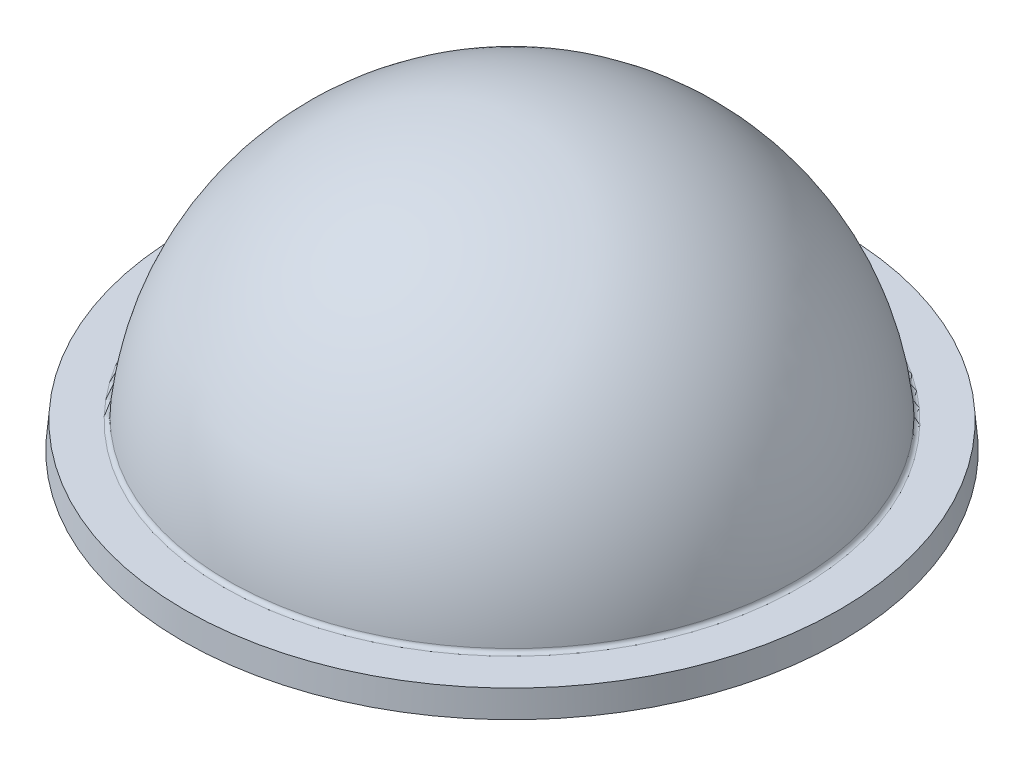
ISO-10303-21;
HEADER;
FILE_DESCRIPTION(('STEP AP214'),'2;1');
FILE_NAME('part.step','',(''),(''),'','','');
FILE_SCHEMA(('AUTOMOTIVE_DESIGN { 1 0 10303 214 1 1 1 1 }'));
ENDSEC;
DATA;
#1=APPLICATION_CONTEXT('core data for automotive mechanical design processes');
#2=APPLICATION_PROTOCOL_DEFINITION('international standard','automotive_design',2000,#1);
#3=PRODUCT_CONTEXT('',#1,'mechanical');
#4=PRODUCT('Part','Part','',(#3));
#5=PRODUCT_RELATED_PRODUCT_CATEGORY('part','',(#4));
#6=PRODUCT_DEFINITION_FORMATION('','',#4);
#7=PRODUCT_DEFINITION_CONTEXT('part definition',#1,'design');
#8=PRODUCT_DEFINITION('design','',#6,#7);
#9=PRODUCT_DEFINITION_SHAPE('','',#8);
#10=(LENGTH_UNIT() NAMED_UNIT(*) SI_UNIT(.MILLI.,.METRE.));
#11=(NAMED_UNIT(*) PLANE_ANGLE_UNIT() SI_UNIT($,.RADIAN.));
#12=(NAMED_UNIT(*) SI_UNIT($,.STERADIAN.) SOLID_ANGLE_UNIT());
#13=UNCERTAINTY_MEASURE_WITH_UNIT(LENGTH_MEASURE(1.E-05),#10,'distance_accuracy_value','');
#14=(GEOMETRIC_REPRESENTATION_CONTEXT(3) GLOBAL_UNCERTAINTY_ASSIGNED_CONTEXT((#13)) GLOBAL_UNIT_ASSIGNED_CONTEXT((#10,
#11,#12)) REPRESENTATION_CONTEXT('',''));
#15=CARTESIAN_POINT('',(0.,0.,0.));
#16=DIRECTION('',(0.,0.,1.));
#17=DIRECTION('',(1.,0.,0.));
#18=AXIS2_PLACEMENT_3D('',#15,#16,#17);
#19=CARTESIAN_POINT('',(0.,0.,0.));
#20=DIRECTION('',(0.,1.,0.));
#21=DIRECTION('',(-1.,0.,0.));
#22=AXIS2_PLACEMENT_3D('',#19,#20,#21);
#23=SPHERICAL_SURFACE('',#22,31.25);
#24=CARTESIAN_POINT('',(0.,1.43129770992367,0.));
#25=DIRECTION('',(0.,-1.,0.));
#26=DIRECTION('',(0.,0.,-1.));
#27=AXIS2_PLACEMENT_3D('',#24,#25,#26);
#28=CIRCLE('',#27,31.2172049816374);
#29=CARTESIAN_POINT('',(0.,1.43129770992367,-31.2172049816374));
#30=VERTEX_POINT('',#29);
#31=EDGE_CURVE('E10',#30,#30,#28,.T.);
#32=ORIENTED_EDGE('',*,*,#31,.T.);
#33=EDGE_LOOP('',(#32));
#34=FACE_BOUND('',#33,.T.);
#35=ADVANCED_FACE('F39',(#34),#23,.F.);
#36=CARTESIAN_POINT('',(0.,0.,0.));
#37=DIRECTION('',(0.,1.,0.));
#38=DIRECTION('',(1.,0.,0.));
#39=AXIS2_PLACEMENT_3D('',#36,#37,#38);
#40=SPHERICAL_SURFACE('',#39,34.35);
#41=CARTESIAN_POINT('',(0.,3.54835007173601,0.));
#42=DIRECTION('',(0.,-1.,0.));
#43=DIRECTION('',(0.,0.,-1.));
#44=AXIS2_PLACEMENT_3D('',#41,#42,#43);
#45=CIRCLE('',#44,34.1662364296744);
#46=CARTESIAN_POINT('',(0.,3.54835007173601,-34.1662364296744));
#47=VERTEX_POINT('',#46);
#48=EDGE_CURVE('E58',#47,#47,#45,.F.);
#49=ORIENTED_EDGE('',*,*,#48,.T.);
#50=EDGE_LOOP('',(#49));
#51=FACE_BOUND('',#50,.T.);
#52=ADVANCED_FACE('F87',(#51),#40,.T.);
#53=CARTESIAN_POINT('',(34.20983045851,3.1,0.));
#54=DIRECTION('',(0.,-1.,0.));
#55=DIRECTION('',(0.,0.,-1.));
#56=AXIS2_PLACEMENT_3D('',#53,#54,#55);
#57=PLANE('',#56);
#58=CARTESIAN_POINT('',(0.,3.1,0.));
#59=DIRECTION('',(0.,-1.,0.));
#60=DIRECTION('',(0.,0.,-1.));
#61=AXIS2_PLACEMENT_3D('',#58,#59,#60);
#62=CIRCLE('',#61,34.6635615596551);
#63=CARTESIAN_POINT('',(0.,3.1,-34.6635615596551));
#64=VERTEX_POINT('',#63);
#65=EDGE_CURVE('E53',#64,#64,#62,.T.);
#66=ORIENTED_EDGE('',*,*,#65,.T.);
#67=EDGE_LOOP('',(#66));
#68=FACE_BOUND('',#67,.T.);
#69=CARTESIAN_POINT('',(0.,3.1,0.));
#70=DIRECTION('',(0.,1.,0.));
#71=DIRECTION('',(0.,0.,1.));
#72=AXIS2_PLACEMENT_3D('',#69,#70,#71);
#73=CIRCLE('',#72,39.3537851430697);
#74=CARTESIAN_POINT('',(0.,3.1,39.3537851430697));
#75=VERTEX_POINT('',#74);
#76=EDGE_CURVE('E64',#75,#75,#73,.T.);
#77=ORIENTED_EDGE('',*,*,#76,.T.);
#78=EDGE_LOOP('',(#77));
#79=FACE_BOUND('',#78,.T.);
#80=ADVANCED_FACE('F83',(#68,#79),#57,.F.);
#81=CARTESIAN_POINT('',(0.,0.,0.));
#82=DIRECTION('',(0.,-1.,0.));
#83=DIRECTION('',(0.,0.,-1.));
#84=AXIS2_PLACEMENT_3D('',#81,#82,#83);
#85=CONICAL_SURFACE('',#84,39.625,0.0872664625997102);
#86=ORIENTED_EDGE('',*,*,#76,.F.);
#87=EDGE_LOOP('',(#86));
#88=FACE_BOUND('',#87,.T.);
#89=CARTESIAN_POINT('',(0.,0.,0.));
#90=DIRECTION('',(0.,1.,0.));
#91=DIRECTION('',(0.,0.,1.));
#92=AXIS2_PLACEMENT_3D('',#89,#90,#91);
#93=CIRCLE('',#92,39.625);
#94=CARTESIAN_POINT('',(0.,0.,39.625));
#95=VERTEX_POINT('',#94);
#96=EDGE_CURVE('E67',#95,#95,#93,.T.);
#97=ORIENTED_EDGE('',*,*,#96,.T.);
#98=EDGE_LOOP('',(#97));
#99=FACE_BOUND('',#98,.T.);
#100=ADVANCED_FACE('F72',(#88,#99),#85,.T.);
#101=CARTESIAN_POINT('',(31.25,0.,0.));
#102=DIRECTION('',(0.,1.,0.));
#103=DIRECTION('',(0.,0.,1.));
#104=AXIS2_PLACEMENT_3D('',#101,#102,#103);
#105=PLANE('',#104);
#106=CARTESIAN_POINT('',(0.,0.,0.));
#107=DIRECTION('',(0.,1.,0.));
#108=DIRECTION('',(0.,0.,1.));
#109=AXIS2_PLACEMENT_3D('',#106,#107,#108);
#110=CIRCLE('',#109,32.715630820756);
#111=CARTESIAN_POINT('',(0.,0.,32.715630820756));
#112=VERTEX_POINT('',#111);
#113=EDGE_CURVE('E47',#112,#112,#110,.T.);
#114=ORIENTED_EDGE('',*,*,#113,.T.);
#115=EDGE_LOOP('',(#114));
#116=FACE_BOUND('',#115,.T.);
#117=ORIENTED_EDGE('',*,*,#96,.F.);
#118=EDGE_LOOP('',(#117));
#119=FACE_BOUND('',#118,.T.);
#120=ADVANCED_FACE('F74',(#116,#119),#105,.F.);
#121=CARTESIAN_POINT('',(0.,3.6,0.));
#122=DIRECTION('',(0.,-1.,0.));
#123=DIRECTION('',(0.,0.,-1.));
#124=AXIS2_PLACEMENT_3D('',#121,#122,#123);
#125=TOROIDAL_SURFACE('',#124,34.6635615596551,0.5);
#126=ORIENTED_EDGE('',*,*,#65,.F.);
#127=EDGE_LOOP('',(#126));
#128=FACE_BOUND('',#127,.T.);
#129=ORIENTED_EDGE('',*,*,#48,.F.);
#130=EDGE_LOOP('',(#129));
#131=FACE_BOUND('',#130,.T.);
#132=ADVANCED_FACE('F76',(#128,#131),#125,.F.);
#133=CARTESIAN_POINT('',(0.,1.5,0.));
#134=DIRECTION('',(0.,1.,0.));
#135=DIRECTION('',(0.,0.,1.));
#136=AXIS2_PLACEMENT_3D('',#133,#134,#135);
#137=TOROIDAL_SURFACE('',#136,32.715630820756,1.5);
#138=ORIENTED_EDGE('',*,*,#31,.F.);
#139=EDGE_LOOP('',(#138));
#140=FACE_BOUND('',#139,.T.);
#141=ORIENTED_EDGE('',*,*,#113,.F.);
#142=EDGE_LOOP('',(#141));
#143=FACE_BOUND('',#142,.T.);
#144=ADVANCED_FACE('F41',(#140,#143),#137,.T.);
#145=CLOSED_SHELL('',(#35,#52,#80,#100,#120,#132,#144));
#146=MANIFOLD_SOLID_BREP('B2',#145);
#147=ADVANCED_BREP_SHAPE_REPRESENTATION('',(#18,#146),#14);
#148=SHAPE_DEFINITION_REPRESENTATION(#9,#147);
ENDSEC;
END-ISO-10303-21;
